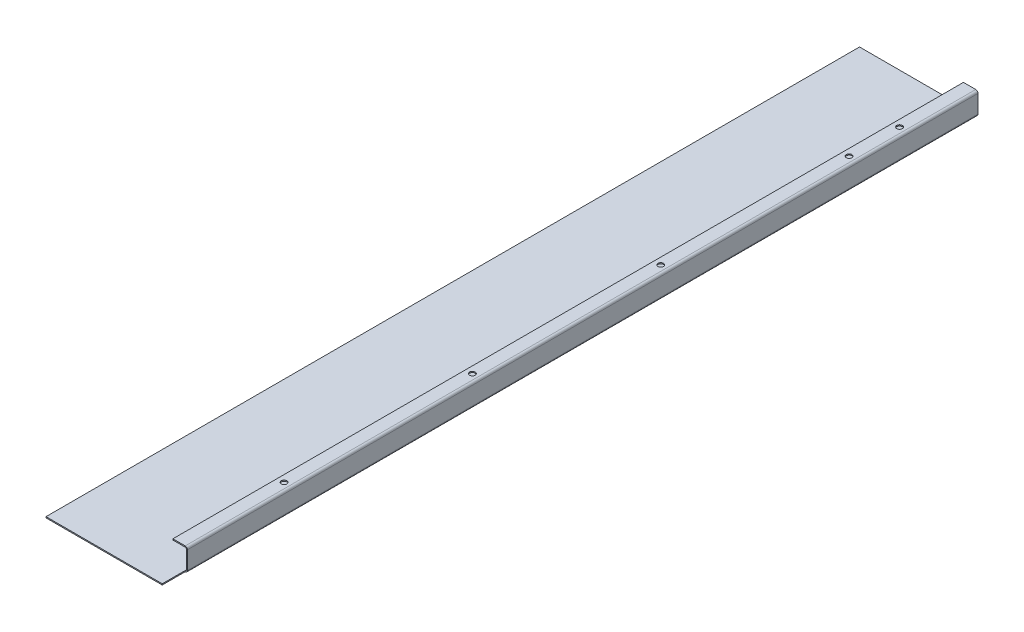
ISO-10303-21;
HEADER;
FILE_DESCRIPTION(('STEP AP214'),'2;1');
FILE_NAME('part.step','',(''),(''),'','','');
FILE_SCHEMA(('AUTOMOTIVE_DESIGN { 1 0 10303 214 1 1 1 1 }'));
ENDSEC;
DATA;
#1=APPLICATION_CONTEXT('core data for automotive mechanical design processes');
#2=APPLICATION_PROTOCOL_DEFINITION('international standard','automotive_design',2000,#1);
#3=PRODUCT_CONTEXT('',#1,'mechanical');
#4=PRODUCT('Part','Part','',(#3));
#5=PRODUCT_RELATED_PRODUCT_CATEGORY('part','',(#4));
#6=PRODUCT_DEFINITION_FORMATION('','',#4);
#7=PRODUCT_DEFINITION_CONTEXT('part definition',#1,'design');
#8=PRODUCT_DEFINITION('design','',#6,#7);
#9=PRODUCT_DEFINITION_SHAPE('','',#8);
#10=(LENGTH_UNIT() NAMED_UNIT(*) SI_UNIT(.MILLI.,.METRE.));
#11=(NAMED_UNIT(*) PLANE_ANGLE_UNIT() SI_UNIT($,.RADIAN.));
#12=(NAMED_UNIT(*) SI_UNIT($,.STERADIAN.) SOLID_ANGLE_UNIT());
#13=UNCERTAINTY_MEASURE_WITH_UNIT(LENGTH_MEASURE(1.E-05),#10,'distance_accuracy_value','');
#14=(GEOMETRIC_REPRESENTATION_CONTEXT(3) GLOBAL_UNCERTAINTY_ASSIGNED_CONTEXT((#13)) GLOBAL_UNIT_ASSIGNED_CONTEXT((#10,
#11,#12)) REPRESENTATION_CONTEXT('',''));
#15=CARTESIAN_POINT('',(0.,0.,0.));
#16=DIRECTION('',(0.,0.,1.));
#17=DIRECTION('',(1.,0.,0.));
#18=AXIS2_PLACEMENT_3D('',#15,#16,#17);
#19=CARTESIAN_POINT('',(105.7,-3.89513105361472E-13,0.));
#20=DIRECTION('',(-1.,0.,0.));
#21=DIRECTION('',(0.,-1.,0.));
#22=AXIS2_PLACEMENT_3D('',#19,#20,#21);
#23=PLANE('',#22);
#24=DIRECTION('',(0.,-1.,0.));
#25=VECTOR('',#24,1.);
#26=CARTESIAN_POINT('',(105.7,-3.89673673445738E-13,-20.5));
#27=LINE('',#26,#25);
#28=CARTESIAN_POINT('',(105.7,17.,-20.5));
#29=VERTEX_POINT('',#28);
#30=CARTESIAN_POINT('',(105.7,0.999999999999942,-20.5));
#31=VERTEX_POINT('',#30);
#32=EDGE_CURVE('E359',#29,#31,#27,.T.);
#33=ORIENTED_EDGE('',*,*,#32,.T.);
#34=DIRECTION('',(0.,0.,-1.));
#35=VECTOR('',#34,1.);
#36=CARTESIAN_POINT('',(105.7,0.999999999999997,0.));
#37=LINE('',#36,#35);
#38=CARTESIAN_POINT('',(105.7,0.999999999999942,-725.7));
#39=VERTEX_POINT('',#38);
#40=EDGE_CURVE('E237',#39,#31,#37,.F.);
#41=ORIENTED_EDGE('',*,*,#40,.F.);
#42=DIRECTION('',(0.,1.,0.));
#43=VECTOR('',#42,1.);
#44=CARTESIAN_POINT('',(105.7,-3.89513105361471E-13,-725.7));
#45=LINE('',#44,#43);
#46=CARTESIAN_POINT('',(105.7,17.,-725.7));
#47=VERTEX_POINT('',#46);
#48=EDGE_CURVE('E232',#39,#47,#45,.T.);
#49=ORIENTED_EDGE('',*,*,#48,.T.);
#50=DIRECTION('',(0.,0.,-1.));
#51=VECTOR('',#50,1.);
#52=CARTESIAN_POINT('',(105.7,17.,-725.7));
#53=LINE('',#52,#51);
#54=EDGE_CURVE('E220',#47,#29,#53,.F.);
#55=ORIENTED_EDGE('',*,*,#54,.T.);
#56=EDGE_LOOP('',(#33,#41,#49,#55));
#57=FACE_BOUND('',#56,.T.);
#58=ADVANCED_FACE('F78',(#57),#23,.F.);
#59=CARTESIAN_POINT('',(104.7,-3.86021624022628E-13,0.));
#60=DIRECTION('',(-1.,0.,0.));
#61=DIRECTION('',(0.,-1.,0.));
#62=AXIS2_PLACEMENT_3D('',#59,#60,#61);
#63=PLANE('',#62);
#64=DIRECTION('',(0.,0.,-1.));
#65=VECTOR('',#64,1.);
#66=CARTESIAN_POINT('',(104.7,1.,0.));
#67=LINE('',#66,#65);
#68=CARTESIAN_POINT('',(104.7,0.999999999999945,-20.5));
#69=VERTEX_POINT('',#68);
#70=CARTESIAN_POINT('',(104.7,0.999999999999934,-725.7));
#71=VERTEX_POINT('',#70);
#72=EDGE_CURVE('E231',#69,#71,#67,.T.);
#73=ORIENTED_EDGE('',*,*,#72,.F.);
#74=DIRECTION('',(0.,-1.,0.));
#75=VECTOR('',#74,1.);
#76=CARTESIAN_POINT('',(104.7,-3.86021624022628E-13,-20.5));
#77=LINE('',#76,#75);
#78=CARTESIAN_POINT('',(104.7,17.,-20.5));
#79=VERTEX_POINT('',#78);
#80=EDGE_CURVE('E360',#79,#69,#77,.T.);
#81=ORIENTED_EDGE('',*,*,#80,.F.);
#82=DIRECTION('',(0.,0.,-1.));
#83=VECTOR('',#82,1.);
#84=CARTESIAN_POINT('',(104.7,17.,-725.7));
#85=LINE('',#84,#83);
#86=CARTESIAN_POINT('',(104.7,17.,-725.7));
#87=VERTEX_POINT('',#86);
#88=EDGE_CURVE('E103',#87,#79,#85,.F.);
#89=ORIENTED_EDGE('',*,*,#88,.F.);
#90=DIRECTION('',(0.,-1.,0.));
#91=VECTOR('',#90,1.);
#92=CARTESIAN_POINT('',(104.7,19.,-725.7));
#93=LINE('',#92,#91);
#94=EDGE_CURVE('E235',#71,#87,#93,.F.);
#95=ORIENTED_EDGE('',*,*,#94,.F.);
#96=EDGE_LOOP('',(#73,#81,#89,#95));
#97=FACE_BOUND('',#96,.T.);
#98=ADVANCED_FACE('F377',(#97),#63,.T.);
#99=CARTESIAN_POINT('',(103.7,0.999999999999937,-725.7));
#100=DIRECTION('',(0.,0.,-1.));
#101=DIRECTION('',(1.,0.,0.));
#102=AXIS2_PLACEMENT_3D('',#99,#100,#101);
#103=CYLINDRICAL_SURFACE('',#102,2.00000000000006);
#104=ORIENTED_EDGE('',*,*,#40,.T.);
#105=CARTESIAN_POINT('',(103.7,0.999999999999957,-20.5000000000004));
#106=DIRECTION('',(0.,0.,-1.));
#107=DIRECTION('',(-1.,0.,0.));
#108=AXIS2_PLACEMENT_3D('',#105,#106,#107);
#109=CIRCLE('',#108,2.);
#110=CARTESIAN_POINT('',(103.7,-1.00000000000004,-20.5000000000004));
#111=VERTEX_POINT('',#110);
#112=EDGE_CURVE('E332',#31,#111,#109,.T.);
#113=ORIENTED_EDGE('',*,*,#112,.T.);
#114=DIRECTION('',(0.,0.,-1.));
#115=VECTOR('',#114,1.);
#116=CARTESIAN_POINT('',(103.7,-1.00000000000012,-725.7));
#117=LINE('',#116,#115);
#118=CARTESIAN_POINT('',(103.7,-1.00000000000012,-725.7));
#119=VERTEX_POINT('',#118);
#120=EDGE_CURVE('E244',#119,#111,#117,.F.);
#121=ORIENTED_EDGE('',*,*,#120,.F.);
#122=CARTESIAN_POINT('',(103.7,0.999999999999937,-725.7));
#123=DIRECTION('',(0.,0.,-1.));
#124=DIRECTION('',(0.,1.,0.));
#125=AXIS2_PLACEMENT_3D('',#122,#123,#124);
#126=CIRCLE('',#125,2.00000000000006);
#127=EDGE_CURVE('E248',#39,#119,#126,.T.);
#128=ORIENTED_EDGE('',*,*,#127,.F.);
#129=EDGE_LOOP('',(#104,#113,#121,#128));
#130=FACE_BOUND('',#129,.T.);
#131=ADVANCED_FACE('F383',(#130),#103,.T.);
#132=CARTESIAN_POINT('',(103.7,0.999999999999937,-725.7));
#133=DIRECTION('',(0.,0.,-1.));
#134=DIRECTION('',(1.,0.,0.));
#135=AXIS2_PLACEMENT_3D('',#132,#133,#134);
#136=CYLINDRICAL_SURFACE('',#135,1.00000000000006);
#137=CARTESIAN_POINT('',(103.7,0.999999999999957,-20.5000000000009));
#138=DIRECTION('',(0.,0.,1.));
#139=DIRECTION('',(0.,-1.,0.));
#140=AXIS2_PLACEMENT_3D('',#137,#138,#139);
#141=CIRCLE('',#140,1.);
#142=CARTESIAN_POINT('',(103.7,0.,-20.5));
#143=VERTEX_POINT('',#142);
#144=EDGE_CURVE('E345',#69,#143,#141,.F.);
#145=ORIENTED_EDGE('',*,*,#144,.F.);
#146=ORIENTED_EDGE('',*,*,#72,.T.);
#147=CARTESIAN_POINT('',(103.7,0.999999999999937,-725.7));
#148=DIRECTION('',(0.,0.,-1.));
#149=DIRECTION('',(0.,1.,0.));
#150=AXIS2_PLACEMENT_3D('',#147,#148,#149);
#151=CIRCLE('',#150,1.00000000000006);
#152=CARTESIAN_POINT('',(103.7,-1.19045398538908E-13,-725.7));
#153=VERTEX_POINT('',#152);
#154=EDGE_CURVE('E234',#71,#153,#151,.T.);
#155=ORIENTED_EDGE('',*,*,#154,.T.);
#156=DIRECTION('',(0.,0.,-1.));
#157=VECTOR('',#156,1.);
#158=CARTESIAN_POINT('',(103.7,-1.19045398538908E-13,-725.7));
#159=LINE('',#158,#157);
#160=EDGE_CURVE('E251',#153,#143,#159,.F.);
#161=ORIENTED_EDGE('',*,*,#160,.T.);
#162=EDGE_LOOP('',(#145,#146,#155,#161));
#163=FACE_BOUND('',#162,.T.);
#164=ADVANCED_FACE('F390',(#163),#136,.F.);
#165=CARTESIAN_POINT('',(103.7,17.,-725.7));
#166=DIRECTION('',(0.,0.,-1.));
#167=DIRECTION('',(0.,1.,0.));
#168=AXIS2_PLACEMENT_3D('',#165,#166,#167);
#169=CYLINDRICAL_SURFACE('',#168,2.);
#170=DIRECTION('',(0.,0.,-1.));
#171=VECTOR('',#170,1.);
#172=CARTESIAN_POINT('',(103.7,19.,0.));
#173=LINE('',#172,#171);
#174=CARTESIAN_POINT('',(103.7,19.,-725.7));
#175=VERTEX_POINT('',#174);
#176=CARTESIAN_POINT('',(103.7,19.,-20.5));
#177=VERTEX_POINT('',#176);
#178=EDGE_CURVE('E200',#175,#177,#173,.F.);
#179=ORIENTED_EDGE('',*,*,#178,.T.);
#180=CARTESIAN_POINT('',(103.7,17.,-20.5000000000004));
#181=DIRECTION('',(0.,0.,-1.));
#182=DIRECTION('',(-1.,0.,0.));
#183=AXIS2_PLACEMENT_3D('',#180,#181,#182);
#184=CIRCLE('',#183,2.);
#185=EDGE_CURVE('E184',#177,#29,#184,.T.);
#186=ORIENTED_EDGE('',*,*,#185,.T.);
#187=ORIENTED_EDGE('',*,*,#54,.F.);
#188=CARTESIAN_POINT('',(103.7,17.,-725.7));
#189=DIRECTION('',(0.,0.,-1.));
#190=DIRECTION('',(-1.,0.,0.));
#191=AXIS2_PLACEMENT_3D('',#188,#189,#190);
#192=CIRCLE('',#191,2.);
#193=EDGE_CURVE('E208',#175,#47,#192,.T.);
#194=ORIENTED_EDGE('',*,*,#193,.F.);
#195=EDGE_LOOP('',(#179,#186,#187,#194));
#196=FACE_BOUND('',#195,.T.);
#197=ADVANCED_FACE('F206',(#196),#169,.T.);
#198=CARTESIAN_POINT('',(103.7,17.,-725.7));
#199=DIRECTION('',(0.,0.,-1.));
#200=DIRECTION('',(0.,1.,0.));
#201=AXIS2_PLACEMENT_3D('',#198,#199,#200);
#202=CYLINDRICAL_SURFACE('',#201,1.);
#203=CARTESIAN_POINT('',(103.7,17.,-20.5000000000009));
#204=DIRECTION('',(0.,0.,1.));
#205=DIRECTION('',(1.,0.,0.));
#206=AXIS2_PLACEMENT_3D('',#203,#204,#205);
#207=CIRCLE('',#206,1.);
#208=CARTESIAN_POINT('',(103.7,18.,-20.5));
#209=VERTEX_POINT('',#208);
#210=EDGE_CURVE('E194',#209,#79,#207,.F.);
#211=ORIENTED_EDGE('',*,*,#210,.F.);
#212=DIRECTION('',(0.,0.,-1.));
#213=VECTOR('',#212,1.);
#214=CARTESIAN_POINT('',(103.7,18.,0.));
#215=LINE('',#214,#213);
#216=CARTESIAN_POINT('',(103.7,18.,-725.7));
#217=VERTEX_POINT('',#216);
#218=EDGE_CURVE('E215',#209,#217,#215,.T.);
#219=ORIENTED_EDGE('',*,*,#218,.T.);
#220=CARTESIAN_POINT('',(103.7,17.,-725.7));
#221=DIRECTION('',(0.,0.,-1.));
#222=DIRECTION('',(-1.,0.,0.));
#223=AXIS2_PLACEMENT_3D('',#220,#221,#222);
#224=CIRCLE('',#223,1.);
#225=EDGE_CURVE('E225',#217,#87,#224,.T.);
#226=ORIENTED_EDGE('',*,*,#225,.T.);
#227=ORIENTED_EDGE('',*,*,#88,.T.);
#228=EDGE_LOOP('',(#211,#219,#226,#227));
#229=FACE_BOUND('',#228,.T.);
#230=ADVANCED_FACE('F314',(#229),#202,.F.);
#231=CARTESIAN_POINT('',(1.40823756520346E-13,19.0000000000008,0.));
#232=DIRECTION('',(0.,-1.,0.));
#233=DIRECTION('',(1.,0.,0.));
#234=AXIS2_PLACEMENT_3D('',#231,#232,#233);
#235=PLANE('',#234);
#236=CARTESIAN_POINT('',(98.7000000000124,19.,-113.7));
#237=DIRECTION('',(0.,1.,0.));
#238=DIRECTION('',(-1.,0.,0.));
#239=AXIS2_PLACEMENT_3D('',#236,#237,#238);
#240=CIRCLE('',#239,2.50000000000001);
#241=CARTESIAN_POINT('',(96.2000000000124,19.0000000000001,-113.7));
#242=VERTEX_POINT('',#241);
#243=EDGE_CURVE('E328',#242,#242,#240,.T.);
#244=ORIENTED_EDGE('',*,*,#243,.F.);
#245=EDGE_LOOP('',(#244));
#246=FACE_BOUND('',#245,.T.);
#247=CARTESIAN_POINT('',(98.7000000000083,19.,-281.7));
#248=DIRECTION('',(0.,1.,0.));
#249=DIRECTION('',(-1.,0.,0.));
#250=AXIS2_PLACEMENT_3D('',#247,#248,#249);
#251=CIRCLE('',#250,2.50000000000001);
#252=CARTESIAN_POINT('',(96.2000000000082,19.0000000000001,-281.7));
#253=VERTEX_POINT('',#252);
#254=EDGE_CURVE('E331',#253,#253,#251,.T.);
#255=ORIENTED_EDGE('',*,*,#254,.F.);
#256=EDGE_LOOP('',(#255));
#257=FACE_BOUND('',#256,.T.);
#258=CARTESIAN_POINT('',(98.7000000000041,19.,-449.7));
#259=DIRECTION('',(0.,1.,0.));
#260=DIRECTION('',(-1.,0.,0.));
#261=AXIS2_PLACEMENT_3D('',#258,#259,#260);
#262=CIRCLE('',#261,2.5);
#263=CARTESIAN_POINT('',(96.2000000000041,19.0000000000001,-449.7));
#264=VERTEX_POINT('',#263);
#265=EDGE_CURVE('E335',#264,#264,#262,.T.);
#266=ORIENTED_EDGE('',*,*,#265,.F.);
#267=EDGE_LOOP('',(#266));
#268=FACE_BOUND('',#267,.T.);
#269=CARTESIAN_POINT('',(98.7,19.,-617.7));
#270=DIRECTION('',(0.,1.,0.));
#271=DIRECTION('',(-1.,0.,0.));
#272=AXIS2_PLACEMENT_3D('',#269,#270,#271);
#273=CIRCLE('',#272,2.50000000000001);
#274=CARTESIAN_POINT('',(96.1999999999999,19.0000000000001,-617.7));
#275=VERTEX_POINT('',#274);
#276=EDGE_CURVE('E338',#275,#275,#273,.T.);
#277=ORIENTED_EDGE('',*,*,#276,.F.);
#278=EDGE_LOOP('',(#277));
#279=FACE_BOUND('',#278,.T.);
#280=CARTESIAN_POINT('',(98.7,19.,-662.7));
#281=DIRECTION('',(0.,1.,0.));
#282=DIRECTION('',(-1.,0.,0.));
#283=AXIS2_PLACEMENT_3D('',#280,#281,#282);
#284=CIRCLE('',#283,2.5);
#285=CARTESIAN_POINT('',(96.1999999999999,19.0000000000001,-662.7));
#286=VERTEX_POINT('',#285);
#287=EDGE_CURVE('E281',#286,#286,#284,.T.);
#288=ORIENTED_EDGE('',*,*,#287,.F.);
#289=EDGE_LOOP('',(#288));
#290=FACE_BOUND('',#289,.T.);
#291=DIRECTION('',(1.,0.,0.));
#292=VECTOR('',#291,1.);
#293=CARTESIAN_POINT('',(1.4090824024163E-13,19.0000000000008,-20.5));
#294=LINE('',#293,#292);
#295=CARTESIAN_POINT('',(92.7000000000001,19.0000000000001,-20.5));
#296=VERTEX_POINT('',#295);
#297=EDGE_CURVE('E95',#296,#177,#294,.T.);
#298=ORIENTED_EDGE('',*,*,#297,.T.);
#299=ORIENTED_EDGE('',*,*,#178,.F.);
#300=DIRECTION('',(-1.,0.,0.));
#301=VECTOR('',#300,1.);
#302=CARTESIAN_POINT('',(1.40823756520346E-13,19.0000000000008,-725.7));
#303=LINE('',#302,#301);
#304=CARTESIAN_POINT('',(92.6999999999999,19.0000000000001,-725.7));
#305=VERTEX_POINT('',#304);
#306=EDGE_CURVE('E322',#175,#305,#303,.T.);
#307=ORIENTED_EDGE('',*,*,#306,.T.);
#308=DIRECTION('',(0.,0.,1.));
#309=VECTOR('',#308,1.);
#310=CARTESIAN_POINT('',(92.7000000000001,19.0000000000001,0.));
#311=LINE('',#310,#309);
#312=EDGE_CURVE('E203',#305,#296,#311,.T.);
#313=ORIENTED_EDGE('',*,*,#312,.T.);
#314=EDGE_LOOP('',(#298,#299,#307,#313));
#315=FACE_BOUND('',#314,.T.);
#316=ADVANCED_FACE('F199',(#246,#257,#268,#279,#290,#315),#235,.F.);
#317=CARTESIAN_POINT('',(1.33680225758394E-13,18.0000000000008,0.));
#318=DIRECTION('',(0.,-1.,0.));
#319=DIRECTION('',(1.,0.,0.));
#320=AXIS2_PLACEMENT_3D('',#317,#318,#319);
#321=PLANE('',#320);
#322=CARTESIAN_POINT('',(98.7,18.,-662.7));
#323=DIRECTION('',(0.,-1.,0.));
#324=DIRECTION('',(1.,0.,0.));
#325=AXIS2_PLACEMENT_3D('',#322,#323,#324);
#326=CIRCLE('',#325,2.5);
#327=CARTESIAN_POINT('',(101.2,18.,-662.7));
#328=VERTEX_POINT('',#327);
#329=EDGE_CURVE('E82',#328,#328,#326,.T.);
#330=ORIENTED_EDGE('',*,*,#329,.F.);
#331=EDGE_LOOP('',(#330));
#332=FACE_BOUND('',#331,.T.);
#333=CARTESIAN_POINT('',(98.7,18.,-617.7));
#334=DIRECTION('',(0.,-1.,0.));
#335=DIRECTION('',(1.,0.,0.));
#336=AXIS2_PLACEMENT_3D('',#333,#334,#335);
#337=CIRCLE('',#336,2.50000000000001);
#338=CARTESIAN_POINT('',(101.2,18.,-617.7));
#339=VERTEX_POINT('',#338);
#340=EDGE_CURVE('E286',#339,#339,#337,.T.);
#341=ORIENTED_EDGE('',*,*,#340,.F.);
#342=EDGE_LOOP('',(#341));
#343=FACE_BOUND('',#342,.T.);
#344=CARTESIAN_POINT('',(98.7000000000041,18.,-449.7));
#345=DIRECTION('',(0.,-1.,0.));
#346=DIRECTION('',(1.,0.,0.));
#347=AXIS2_PLACEMENT_3D('',#344,#345,#346);
#348=CIRCLE('',#347,2.5);
#349=CARTESIAN_POINT('',(101.200000000004,18.,-449.7));
#350=VERTEX_POINT('',#349);
#351=EDGE_CURVE('E284',#350,#350,#348,.T.);
#352=ORIENTED_EDGE('',*,*,#351,.F.);
#353=EDGE_LOOP('',(#352));
#354=FACE_BOUND('',#353,.T.);
#355=CARTESIAN_POINT('',(98.7000000000083,18.,-281.7));
#356=DIRECTION('',(0.,-1.,0.));
#357=DIRECTION('',(1.,0.,0.));
#358=AXIS2_PLACEMENT_3D('',#355,#356,#357);
#359=CIRCLE('',#358,2.50000000000001);
#360=CARTESIAN_POINT('',(101.200000000008,18.,-281.7));
#361=VERTEX_POINT('',#360);
#362=EDGE_CURVE('E280',#361,#361,#359,.T.);
#363=ORIENTED_EDGE('',*,*,#362,.F.);
#364=EDGE_LOOP('',(#363));
#365=FACE_BOUND('',#364,.T.);
#366=CARTESIAN_POINT('',(98.7000000000124,18.,-113.7));
#367=DIRECTION('',(0.,-1.,0.));
#368=DIRECTION('',(1.,0.,0.));
#369=AXIS2_PLACEMENT_3D('',#366,#367,#368);
#370=CIRCLE('',#369,2.50000000000001);
#371=CARTESIAN_POINT('',(101.200000000012,18.,-113.7));
#372=VERTEX_POINT('',#371);
#373=EDGE_CURVE('E277',#372,#372,#370,.T.);
#374=ORIENTED_EDGE('',*,*,#373,.F.);
#375=EDGE_LOOP('',(#374));
#376=FACE_BOUND('',#375,.T.);
#377=ORIENTED_EDGE('',*,*,#218,.F.);
#378=DIRECTION('',(1.,0.,0.));
#379=VECTOR('',#378,1.);
#380=CARTESIAN_POINT('',(1.30156829789573E-13,18.0000000000008,-20.5));
#381=LINE('',#380,#379);
#382=CARTESIAN_POINT('',(92.7000000000001,18.0000000000001,-20.5));
#383=VERTEX_POINT('',#382);
#384=EDGE_CURVE('E179',#383,#209,#381,.T.);
#385=ORIENTED_EDGE('',*,*,#384,.F.);
#386=DIRECTION('',(0.,0.,-1.));
#387=VECTOR('',#386,1.);
#388=CARTESIAN_POINT('',(92.7000000000001,18.0000000000001,0.));
#389=LINE('',#388,#387);
#390=CARTESIAN_POINT('',(92.6999999999999,18.0000000000001,-725.7));
#391=VERTEX_POINT('',#390);
#392=EDGE_CURVE('E213',#391,#383,#389,.F.);
#393=ORIENTED_EDGE('',*,*,#392,.F.);
#394=DIRECTION('',(1.,0.,0.));
#395=VECTOR('',#394,1.);
#396=CARTESIAN_POINT('',(92.6999999999999,18.0000000000001,-725.7));
#397=LINE('',#396,#395);
#398=EDGE_CURVE('E210',#217,#391,#397,.F.);
#399=ORIENTED_EDGE('',*,*,#398,.F.);
#400=EDGE_LOOP('',(#377,#385,#393,#399));
#401=FACE_BOUND('',#400,.T.);
#402=ADVANCED_FACE('F296',(#332,#343,#354,#365,#376,#401),#321,.T.);
#403=CARTESIAN_POINT('',(92.7000000000001,19.0000000000001,0.));
#404=DIRECTION('',(1.,0.,0.));
#405=DIRECTION('',(0.,1.,0.));
#406=AXIS2_PLACEMENT_3D('',#403,#404,#405);
#407=PLANE('',#406);
#408=DIRECTION('',(0.,-1.,0.));
#409=VECTOR('',#408,1.);
#410=CARTESIAN_POINT('',(92.7000000000001,18.0000000000001,-20.5));
#411=LINE('',#410,#409);
#412=EDGE_CURVE('E204',#383,#296,#411,.F.);
#413=ORIENTED_EDGE('',*,*,#412,.T.);
#414=ORIENTED_EDGE('',*,*,#312,.F.);
#415=DIRECTION('',(0.,-1.,0.));
#416=VECTOR('',#415,1.);
#417=CARTESIAN_POINT('',(92.6999999999999,19.0000000000001,-725.7));
#418=LINE('',#417,#416);
#419=EDGE_CURVE('E228',#305,#391,#418,.T.);
#420=ORIENTED_EDGE('',*,*,#419,.T.);
#421=ORIENTED_EDGE('',*,*,#392,.T.);
#422=EDGE_LOOP('',(#413,#414,#420,#421));
#423=FACE_BOUND('',#422,.T.);
#424=ADVANCED_FACE('F299',(#423),#407,.F.);
#425=CARTESIAN_POINT('',(105.7,19.,-725.7));
#426=DIRECTION('',(0.,0.,1.));
#427=DIRECTION('',(1.,0.,0.));
#428=AXIS2_PLACEMENT_3D('',#425,#426,#427);
#429=PLANE('',#428);
#430=DIRECTION('',(1.,0.,0.));
#431=VECTOR('',#430,1.);
#432=CARTESIAN_POINT('',(104.7,17.,-725.7));
#433=LINE('',#432,#431);
#434=EDGE_CURVE('E222',#87,#47,#433,.T.);
#435=ORIENTED_EDGE('',*,*,#434,.T.);
#436=ORIENTED_EDGE('',*,*,#48,.F.);
#437=DIRECTION('',(-1.,0.,0.));
#438=VECTOR('',#437,1.);
#439=CARTESIAN_POINT('',(104.7,0.999999999999945,-725.7));
#440=LINE('',#439,#438);
#441=EDGE_CURVE('E240',#71,#39,#440,.F.);
#442=ORIENTED_EDGE('',*,*,#441,.F.);
#443=ORIENTED_EDGE('',*,*,#94,.T.);
#444=EDGE_LOOP('',(#435,#436,#442,#443));
#445=FACE_BOUND('',#444,.T.);
#446=ADVANCED_FACE('F367',(#445),#429,.F.);
#447=CARTESIAN_POINT('',(-1.38777878078145E-13,-1.,-725.7));
#448=DIRECTION('',(0.,0.,-1.));
#449=DIRECTION('',(-1.,0.,0.));
#450=AXIS2_PLACEMENT_3D('',#447,#448,#449);
#451=PLANE('',#450);
#452=DIRECTION('',(-1.,0.,0.));
#453=VECTOR('',#452,1.);
#454=CARTESIAN_POINT('',(-1.38777878078145E-13,0.,-725.7));
#455=LINE('',#454,#453);
#456=CARTESIAN_POINT('',(-1.38777878078145E-13,0.,-725.7));
#457=VERTEX_POINT('',#456);
#458=EDGE_CURVE('E265',#153,#457,#455,.T.);
#459=ORIENTED_EDGE('',*,*,#458,.F.);
#460=DIRECTION('',(0.,-1.,0.));
#461=VECTOR('',#460,1.);
#462=CARTESIAN_POINT('',(103.7,-1.19045398538908E-13,-725.7));
#463=LINE('',#462,#461);
#464=EDGE_CURVE('E247',#153,#119,#463,.T.);
#465=ORIENTED_EDGE('',*,*,#464,.T.);
#466=DIRECTION('',(-1.,0.,0.));
#467=VECTOR('',#466,1.);
#468=CARTESIAN_POINT('',(-1.38777878078145E-13,-1.,-725.7));
#469=LINE('',#468,#467);
#470=CARTESIAN_POINT('',(-1.38777878078145E-13,-1.,-725.7));
#471=VERTEX_POINT('',#470);
#472=EDGE_CURVE('E268',#119,#471,#469,.T.);
#473=ORIENTED_EDGE('',*,*,#472,.T.);
#474=DIRECTION('',(0.,1.,0.));
#475=VECTOR('',#474,1.);
#476=CARTESIAN_POINT('',(-1.38777878078145E-13,-1.,-725.7));
#477=LINE('',#476,#475);
#478=EDGE_CURVE('E13',#471,#457,#477,.T.);
#479=ORIENTED_EDGE('',*,*,#478,.T.);
#480=EDGE_LOOP('',(#459,#465,#473,#479));
#481=FACE_BOUND('',#480,.T.);
#482=ADVANCED_FACE('F372',(#481),#451,.T.);
#483=CARTESIAN_POINT('',(0.,-1.,0.));
#484=DIRECTION('',(0.,-1.,0.));
#485=DIRECTION('',(0.,0.,-1.));
#486=AXIS2_PLACEMENT_3D('',#483,#484,#485);
#487=PLANE('',#486);
#488=ORIENTED_EDGE('',*,*,#472,.F.);
#489=ORIENTED_EDGE('',*,*,#120,.T.);
#490=DIRECTION('',(0.,0.,-1.));
#491=VECTOR('',#490,1.);
#492=CARTESIAN_POINT('',(103.7,-1.00000000000012,-725.7));
#493=LINE('',#492,#491);
#494=CARTESIAN_POINT('',(103.7,-1.00000000000004,0.));
#495=VERTEX_POINT('',#494);
#496=EDGE_CURVE('E350',#111,#495,#493,.F.);
#497=ORIENTED_EDGE('',*,*,#496,.T.);
#498=DIRECTION('',(1.,0.,0.));
#499=VECTOR('',#498,1.);
#500=CARTESIAN_POINT('',(0.,-1.,0.));
#501=LINE('',#500,#499);
#502=CARTESIAN_POINT('',(0.,-1.,0.));
#503=VERTEX_POINT('',#502);
#504=EDGE_CURVE('E264',#503,#495,#501,.T.);
#505=ORIENTED_EDGE('',*,*,#504,.F.);
#506=DIRECTION('',(0.,0.,1.));
#507=VECTOR('',#506,1.);
#508=CARTESIAN_POINT('',(0.,-1.,0.));
#509=LINE('',#508,#507);
#510=EDGE_CURVE('E261',#471,#503,#509,.T.);
#511=ORIENTED_EDGE('',*,*,#510,.F.);
#512=EDGE_LOOP('',(#488,#489,#497,#505,#511));
#513=FACE_BOUND('',#512,.T.);
#514=ADVANCED_FACE('F400',(#513),#487,.T.);
#515=CARTESIAN_POINT('',(0.,0.,0.));
#516=DIRECTION('',(0.,-1.,0.));
#517=DIRECTION('',(0.,0.,-1.));
#518=AXIS2_PLACEMENT_3D('',#515,#516,#517);
#519=PLANE('',#518);
#520=ORIENTED_EDGE('',*,*,#160,.F.);
#521=ORIENTED_EDGE('',*,*,#458,.T.);
#522=DIRECTION('',(0.,0.,1.));
#523=VECTOR('',#522,1.);
#524=CARTESIAN_POINT('',(0.,0.,0.));
#525=LINE('',#524,#523);
#526=CARTESIAN_POINT('',(0.,0.,0.));
#527=VERTEX_POINT('',#526);
#528=EDGE_CURVE('E258',#457,#527,#525,.T.);
#529=ORIENTED_EDGE('',*,*,#528,.T.);
#530=DIRECTION('',(1.,0.,0.));
#531=VECTOR('',#530,1.);
#532=CARTESIAN_POINT('',(0.,0.,0.));
#533=LINE('',#532,#531);
#534=CARTESIAN_POINT('',(103.7,0.,0.));
#535=VERTEX_POINT('',#534);
#536=EDGE_CURVE('E272',#527,#535,#533,.T.);
#537=ORIENTED_EDGE('',*,*,#536,.T.);
#538=DIRECTION('',(0.,0.,-1.));
#539=VECTOR('',#538,1.);
#540=CARTESIAN_POINT('',(103.7,-1.19045398538908E-13,-725.7));
#541=LINE('',#540,#539);
#542=EDGE_CURVE('E353',#143,#535,#541,.F.);
#543=ORIENTED_EDGE('',*,*,#542,.F.);
#544=EDGE_LOOP('',(#520,#521,#529,#537,#543));
#545=FACE_BOUND('',#544,.T.);
#546=ADVANCED_FACE('F403',(#545),#519,.F.);
#547=CARTESIAN_POINT('',(0.,-1.,0.));
#548=DIRECTION('',(-1.,0.,0.));
#549=DIRECTION('',(0.,0.,1.));
#550=AXIS2_PLACEMENT_3D('',#547,#548,#549);
#551=PLANE('',#550);
#552=ORIENTED_EDGE('',*,*,#528,.F.);
#553=ORIENTED_EDGE('',*,*,#478,.F.);
#554=ORIENTED_EDGE('',*,*,#510,.T.);
#555=DIRECTION('',(0.,1.,0.));
#556=VECTOR('',#555,1.);
#557=CARTESIAN_POINT('',(0.,-1.,0.));
#558=LINE('',#557,#556);
#559=EDGE_CURVE('E87',#503,#527,#558,.T.);
#560=ORIENTED_EDGE('',*,*,#559,.T.);
#561=EDGE_LOOP('',(#552,#553,#554,#560));
#562=FACE_BOUND('',#561,.T.);
#563=ADVANCED_FACE('F80',(#562),#551,.T.);
#564=CARTESIAN_POINT('',(0.,-1.,0.));
#565=DIRECTION('',(0.,0.,1.));
#566=DIRECTION('',(1.,0.,0.));
#567=AXIS2_PLACEMENT_3D('',#564,#565,#566);
#568=PLANE('',#567);
#569=DIRECTION('',(0.,-1.,0.));
#570=VECTOR('',#569,1.);
#571=CARTESIAN_POINT('',(103.7,0.,0.));
#572=LINE('',#571,#570);
#573=EDGE_CURVE('E256',#535,#495,#572,.T.);
#574=ORIENTED_EDGE('',*,*,#573,.F.);
#575=ORIENTED_EDGE('',*,*,#536,.F.);
#576=ORIENTED_EDGE('',*,*,#559,.F.);
#577=ORIENTED_EDGE('',*,*,#504,.T.);
#578=EDGE_LOOP('',(#574,#575,#576,#577));
#579=FACE_BOUND('',#578,.T.);
#580=ADVANCED_FACE('F398',(#579),#568,.T.);
#581=CARTESIAN_POINT('',(103.7,0.999999999999937,-725.7));
#582=DIRECTION('',(0.,0.,1.));
#583=DIRECTION('',(0.,-1.,0.));
#584=AXIS2_PLACEMENT_3D('',#581,#582,#583);
#585=PLANE('',#584);
#586=ORIENTED_EDGE('',*,*,#154,.F.);
#587=ORIENTED_EDGE('',*,*,#441,.T.);
#588=ORIENTED_EDGE('',*,*,#127,.T.);
#589=ORIENTED_EDGE('',*,*,#464,.F.);
#590=EDGE_LOOP('',(#586,#587,#588,#589));
#591=FACE_BOUND('',#590,.T.);
#592=ADVANCED_FACE('F395',(#591),#585,.F.);
#593=CARTESIAN_POINT('',(103.7,17.,-725.7));
#594=DIRECTION('',(0.,0.,1.));
#595=DIRECTION('',(1.,0.,0.));
#596=AXIS2_PLACEMENT_3D('',#593,#594,#595);
#597=PLANE('',#596);
#598=ORIENTED_EDGE('',*,*,#225,.F.);
#599=DIRECTION('',(0.,-1.,0.));
#600=VECTOR('',#599,1.);
#601=CARTESIAN_POINT('',(103.7,18.,-725.7));
#602=LINE('',#601,#600);
#603=EDGE_CURVE('E211',#217,#175,#602,.F.);
#604=ORIENTED_EDGE('',*,*,#603,.T.);
#605=ORIENTED_EDGE('',*,*,#193,.T.);
#606=ORIENTED_EDGE('',*,*,#434,.F.);
#607=EDGE_LOOP('',(#598,#604,#605,#606));
#608=FACE_BOUND('',#607,.T.);
#609=ADVANCED_FACE('F318',(#608),#597,.F.);
#610=CARTESIAN_POINT('',(92.6999999999999,19.0000000000001,-725.7));
#611=DIRECTION('',(0.,0.,1.));
#612=DIRECTION('',(0.,-1.,0.));
#613=AXIS2_PLACEMENT_3D('',#610,#611,#612);
#614=PLANE('',#613);
#615=ORIENTED_EDGE('',*,*,#603,.F.);
#616=ORIENTED_EDGE('',*,*,#398,.T.);
#617=ORIENTED_EDGE('',*,*,#419,.F.);
#618=ORIENTED_EDGE('',*,*,#306,.F.);
#619=EDGE_LOOP('',(#615,#616,#617,#618));
#620=FACE_BOUND('',#619,.T.);
#621=ADVANCED_FACE('F320',(#620),#614,.F.);
#622=CARTESIAN_POINT('',(98.7000000000123,9.00000000000004,-113.7));
#623=DIRECTION('',(0.,1.,0.));
#624=DIRECTION('',(-1.,0.,0.));
#625=AXIS2_PLACEMENT_3D('',#622,#623,#624);
#626=CYLINDRICAL_SURFACE('',#625,2.50000000000001);
#627=ORIENTED_EDGE('',*,*,#373,.T.);
#628=EDGE_LOOP('',(#627));
#629=FACE_BOUND('',#628,.T.);
#630=ORIENTED_EDGE('',*,*,#243,.T.);
#631=EDGE_LOOP('',(#630));
#632=FACE_BOUND('',#631,.T.);
#633=ADVANCED_FACE('F460',(#629,#632),#626,.F.);
#634=CARTESIAN_POINT('',(98.7000000000082,9.00000000000004,-281.7));
#635=DIRECTION('',(0.,1.,0.));
#636=DIRECTION('',(-1.,0.,0.));
#637=AXIS2_PLACEMENT_3D('',#634,#635,#636);
#638=CYLINDRICAL_SURFACE('',#637,2.50000000000001);
#639=ORIENTED_EDGE('',*,*,#362,.T.);
#640=EDGE_LOOP('',(#639));
#641=FACE_BOUND('',#640,.T.);
#642=ORIENTED_EDGE('',*,*,#254,.T.);
#643=EDGE_LOOP('',(#642));
#644=FACE_BOUND('',#643,.T.);
#645=ADVANCED_FACE('F456',(#641,#644),#638,.F.);
#646=CARTESIAN_POINT('',(98.7000000000041,9.00000000000004,-449.7));
#647=DIRECTION('',(0.,1.,0.));
#648=DIRECTION('',(-1.,0.,0.));
#649=AXIS2_PLACEMENT_3D('',#646,#647,#648);
#650=CYLINDRICAL_SURFACE('',#649,2.5);
#651=ORIENTED_EDGE('',*,*,#351,.T.);
#652=EDGE_LOOP('',(#651));
#653=FACE_BOUND('',#652,.T.);
#654=ORIENTED_EDGE('',*,*,#265,.T.);
#655=EDGE_LOOP('',(#654));
#656=FACE_BOUND('',#655,.T.);
#657=ADVANCED_FACE('F453',(#653,#656),#650,.F.);
#658=CARTESIAN_POINT('',(98.6999999999999,9.00000000000004,-617.7));
#659=DIRECTION('',(0.,1.,0.));
#660=DIRECTION('',(-1.,0.,0.));
#661=AXIS2_PLACEMENT_3D('',#658,#659,#660);
#662=CYLINDRICAL_SURFACE('',#661,2.50000000000001);
#663=ORIENTED_EDGE('',*,*,#340,.T.);
#664=EDGE_LOOP('',(#663));
#665=FACE_BOUND('',#664,.T.);
#666=ORIENTED_EDGE('',*,*,#276,.T.);
#667=EDGE_LOOP('',(#666));
#668=FACE_BOUND('',#667,.T.);
#669=ADVANCED_FACE('F447',(#665,#668),#662,.F.);
#670=CARTESIAN_POINT('',(98.6999999999999,9.00000000000004,-662.7));
#671=DIRECTION('',(0.,1.,0.));
#672=DIRECTION('',(-1.,0.,0.));
#673=AXIS2_PLACEMENT_3D('',#670,#671,#672);
#674=CYLINDRICAL_SURFACE('',#673,2.5);
#675=ORIENTED_EDGE('',*,*,#329,.T.);
#676=EDGE_LOOP('',(#675));
#677=FACE_BOUND('',#676,.T.);
#678=ORIENTED_EDGE('',*,*,#287,.T.);
#679=EDGE_LOOP('',(#678));
#680=FACE_BOUND('',#679,.T.);
#681=ADVANCED_FACE('F293',(#677,#680),#674,.F.);
#682=CARTESIAN_POINT('',(103.7,0.999999999999957,-20.5000000000004));
#683=DIRECTION('',(0.,0.,1.));
#684=DIRECTION('',(1.,0.,0.));
#685=AXIS2_PLACEMENT_3D('',#682,#683,#684);
#686=PLANE('',#685);
#687=DIRECTION('',(-1.,0.,0.));
#688=VECTOR('',#687,1.);
#689=CARTESIAN_POINT('',(105.7,0.999999999999834,-20.5));
#690=LINE('',#689,#688);
#691=EDGE_CURVE('E183',#31,#69,#690,.T.);
#692=ORIENTED_EDGE('',*,*,#691,.T.);
#693=ORIENTED_EDGE('',*,*,#144,.T.);
#694=DIRECTION('',(0.,-1.,0.));
#695=VECTOR('',#694,1.);
#696=CARTESIAN_POINT('',(103.7,-3.7871752517641E-13,-20.5));
#697=LINE('',#696,#695);
#698=EDGE_CURVE('E348',#143,#111,#697,.T.);
#699=ORIENTED_EDGE('',*,*,#698,.T.);
#700=ORIENTED_EDGE('',*,*,#112,.F.);
#701=EDGE_LOOP('',(#692,#693,#699,#700));
#702=FACE_BOUND('',#701,.T.);
#703=ADVANCED_FACE('F439',(#702),#686,.T.);
#704=CARTESIAN_POINT('',(103.7,0.,-10.25));
#705=DIRECTION('',(-1.,0.,0.));
#706=DIRECTION('',(0.,0.,-1.));
#707=AXIS2_PLACEMENT_3D('',#704,#705,#706);
#708=PLANE('',#707);
#709=ORIENTED_EDGE('',*,*,#542,.T.);
#710=ORIENTED_EDGE('',*,*,#573,.T.);
#711=ORIENTED_EDGE('',*,*,#496,.F.);
#712=ORIENTED_EDGE('',*,*,#698,.F.);
#713=EDGE_LOOP('',(#709,#710,#711,#712));
#714=FACE_BOUND('',#713,.T.);
#715=ADVANCED_FACE('F421',(#714),#708,.F.);
#716=CARTESIAN_POINT('',(103.7,17.,-20.5000000000004));
#717=DIRECTION('',(0.,0.,1.));
#718=DIRECTION('',(1.,0.,0.));
#719=AXIS2_PLACEMENT_3D('',#716,#717,#718);
#720=PLANE('',#719);
#721=ORIENTED_EDGE('',*,*,#210,.T.);
#722=DIRECTION('',(1.,0.,0.));
#723=VECTOR('',#722,1.);
#724=CARTESIAN_POINT('',(104.7,17.,-20.5));
#725=LINE('',#724,#723);
#726=EDGE_CURVE('E189',#79,#29,#725,.T.);
#727=ORIENTED_EDGE('',*,*,#726,.T.);
#728=ORIENTED_EDGE('',*,*,#185,.F.);
#729=DIRECTION('',(0.,1.,0.));
#730=VECTOR('',#729,1.);
#731=CARTESIAN_POINT('',(103.7,17.9999999999999,-20.5));
#732=LINE('',#731,#730);
#733=EDGE_CURVE('E175',#209,#177,#732,.T.);
#734=ORIENTED_EDGE('',*,*,#733,.F.);
#735=EDGE_LOOP('',(#721,#727,#728,#734));
#736=FACE_BOUND('',#735,.T.);
#737=ADVANCED_FACE('F188',(#736),#720,.T.);
#738=CARTESIAN_POINT('',(104.7,-3.86021624022628E-13,-20.5));
#739=DIRECTION('',(0.,0.,-1.));
#740=DIRECTION('',(0.,-1.,0.));
#741=AXIS2_PLACEMENT_3D('',#738,#739,#740);
#742=PLANE('',#741);
#743=ORIENTED_EDGE('',*,*,#80,.T.);
#744=ORIENTED_EDGE('',*,*,#691,.F.);
#745=ORIENTED_EDGE('',*,*,#32,.F.);
#746=ORIENTED_EDGE('',*,*,#726,.F.);
#747=EDGE_LOOP('',(#743,#744,#745,#746));
#748=FACE_BOUND('',#747,.T.);
#749=ADVANCED_FACE('F437',(#748),#742,.F.);
#750=CARTESIAN_POINT('',(1.30156829789573E-13,18.0000000000008,-20.5));
#751=DIRECTION('',(0.,0.,-1.));
#752=DIRECTION('',(1.,0.,0.));
#753=AXIS2_PLACEMENT_3D('',#750,#751,#752);
#754=PLANE('',#753);
#755=ORIENTED_EDGE('',*,*,#384,.T.);
#756=ORIENTED_EDGE('',*,*,#733,.T.);
#757=ORIENTED_EDGE('',*,*,#297,.F.);
#758=ORIENTED_EDGE('',*,*,#412,.F.);
#759=EDGE_LOOP('',(#755,#756,#757,#758));
#760=FACE_BOUND('',#759,.T.);
#761=ADVANCED_FACE('F177',(#760),#754,.F.);
#762=CLOSED_SHELL('',(#58,#98,#131,#164,#197,#230,#316,#402,#424,#446,#482,#514,#546,#563,#580,
#592,#609,#621,#633,#645,#657,#669,#681,#703,#715,#737,#749,#761));
#763=MANIFOLD_SOLID_BREP('B2',#762);
#764=ADVANCED_BREP_SHAPE_REPRESENTATION('',(#18,#763),#14);
#765=SHAPE_DEFINITION_REPRESENTATION(#9,#764);
ENDSEC;
END-ISO-10303-21;
